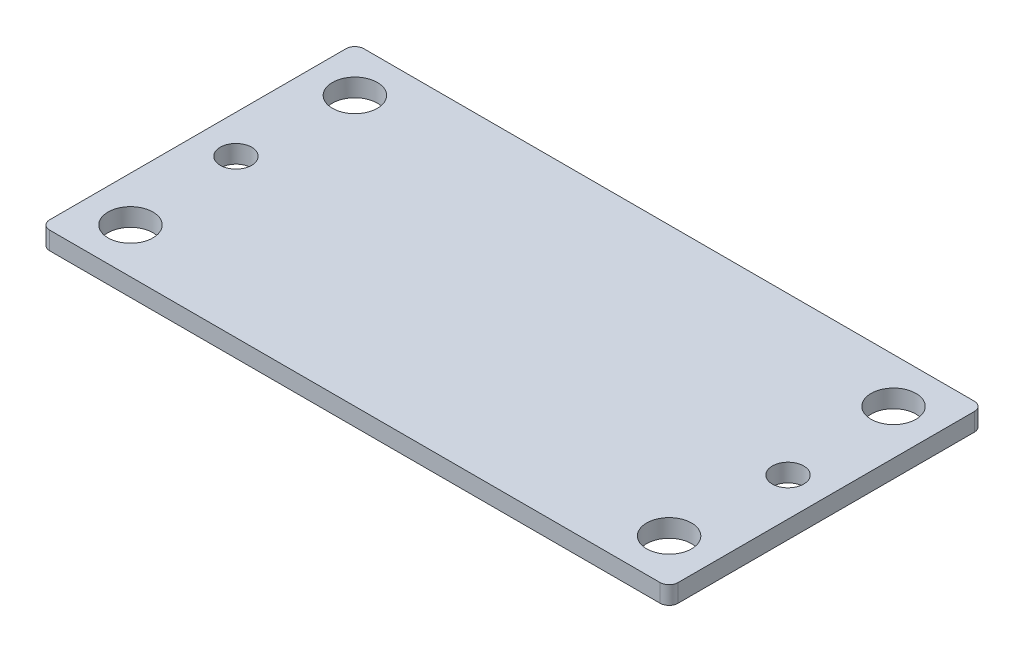
ISO-10303-21;
HEADER;
FILE_DESCRIPTION(('STEP AP214'),'2;1');
FILE_NAME('part.step','',(''),(''),'','','');
FILE_SCHEMA(('AUTOMOTIVE_DESIGN { 1 0 10303 214 1 1 1 1 }'));
ENDSEC;
DATA;
#1=APPLICATION_CONTEXT('core data for automotive mechanical design processes');
#2=APPLICATION_PROTOCOL_DEFINITION('international standard','automotive_design',2000,#1);
#3=PRODUCT_CONTEXT('',#1,'mechanical');
#4=PRODUCT('Part','Part','',(#3));
#5=PRODUCT_RELATED_PRODUCT_CATEGORY('part','',(#4));
#6=PRODUCT_DEFINITION_FORMATION('','',#4);
#7=PRODUCT_DEFINITION_CONTEXT('part definition',#1,'design');
#8=PRODUCT_DEFINITION('design','',#6,#7);
#9=PRODUCT_DEFINITION_SHAPE('','',#8);
#10=(LENGTH_UNIT() NAMED_UNIT(*) SI_UNIT(.MILLI.,.METRE.));
#11=(NAMED_UNIT(*) PLANE_ANGLE_UNIT() SI_UNIT($,.RADIAN.));
#12=(NAMED_UNIT(*) SI_UNIT($,.STERADIAN.) SOLID_ANGLE_UNIT());
#13=UNCERTAINTY_MEASURE_WITH_UNIT(LENGTH_MEASURE(1.E-05),#10,'distance_accuracy_value','');
#14=(GEOMETRIC_REPRESENTATION_CONTEXT(3) GLOBAL_UNCERTAINTY_ASSIGNED_CONTEXT((#13)) GLOBAL_UNIT_ASSIGNED_CONTEXT((#10,
#11,#12)) REPRESENTATION_CONTEXT('',''));
#15=CARTESIAN_POINT('',(0.,0.,0.));
#16=DIRECTION('',(0.,0.,1.));
#17=DIRECTION('',(1.,0.,0.));
#18=AXIS2_PLACEMENT_3D('',#15,#16,#17);
#19=CARTESIAN_POINT('',(0.,2.,0.));
#20=DIRECTION('',(1.,0.,0.));
#21=DIRECTION('',(0.,0.,-1.));
#22=AXIS2_PLACEMENT_3D('',#19,#20,#21);
#23=PLANE('',#22);
#24=DIRECTION('',(0.,0.,1.));
#25=VECTOR('',#24,1.);
#26=CARTESIAN_POINT('',(0.,2.,0.));
#27=LINE('',#26,#25);
#28=CARTESIAN_POINT('',(0.,2.,-34.));
#29=VERTEX_POINT('',#28);
#30=CARTESIAN_POINT('',(0.,2.,-1.));
#31=VERTEX_POINT('',#30);
#32=EDGE_CURVE('E128',#29,#31,#27,.T.);
#33=ORIENTED_EDGE('',*,*,#32,.F.);
#34=DIRECTION('',(0.,-1.,0.));
#35=VECTOR('',#34,1.);
#36=CARTESIAN_POINT('',(0.,2.,-34.));
#37=LINE('',#36,#35);
#38=CARTESIAN_POINT('',(0.,0.,-34.));
#39=VERTEX_POINT('',#38);
#40=EDGE_CURVE('E112',#29,#39,#37,.T.);
#41=ORIENTED_EDGE('',*,*,#40,.T.);
#42=DIRECTION('',(0.,0.,1.));
#43=VECTOR('',#42,1.);
#44=CARTESIAN_POINT('',(0.,0.,0.));
#45=LINE('',#44,#43);
#46=CARTESIAN_POINT('',(0.,0.,-1.));
#47=VERTEX_POINT('',#46);
#48=EDGE_CURVE('E125',#39,#47,#45,.T.);
#49=ORIENTED_EDGE('',*,*,#48,.T.);
#50=DIRECTION('',(0.,-1.,0.));
#51=VECTOR('',#50,1.);
#52=CARTESIAN_POINT('',(0.,2.,-1.));
#53=LINE('',#52,#51);
#54=EDGE_CURVE('E131',#47,#31,#53,.F.);
#55=ORIENTED_EDGE('',*,*,#54,.T.);
#56=EDGE_LOOP('',(#33,#41,#49,#55));
#57=FACE_BOUND('',#56,.T.);
#58=ADVANCED_FACE('F41',(#57),#23,.F.);
#59=CARTESIAN_POINT('',(0.,2.,0.));
#60=DIRECTION('',(0.,0.,-1.));
#61=DIRECTION('',(-1.,0.,0.));
#62=AXIS2_PLACEMENT_3D('',#59,#60,#61);
#63=PLANE('',#62);
#64=DIRECTION('',(1.,0.,0.));
#65=VECTOR('',#64,1.);
#66=CARTESIAN_POINT('',(0.,2.,0.));
#67=LINE('',#66,#65);
#68=CARTESIAN_POINT('',(1.,2.,0.));
#69=VERTEX_POINT('',#68);
#70=CARTESIAN_POINT('',(69.,2.,0.));
#71=VERTEX_POINT('',#70);
#72=EDGE_CURVE('E193',#69,#71,#67,.T.);
#73=ORIENTED_EDGE('',*,*,#72,.F.);
#74=DIRECTION('',(0.,-1.,0.));
#75=VECTOR('',#74,1.);
#76=CARTESIAN_POINT('',(1.,2.,0.));
#77=LINE('',#76,#75);
#78=CARTESIAN_POINT('',(1.,0.,0.));
#79=VERTEX_POINT('',#78);
#80=EDGE_CURVE('E184',#69,#79,#77,.T.);
#81=ORIENTED_EDGE('',*,*,#80,.T.);
#82=DIRECTION('',(1.,0.,0.));
#83=VECTOR('',#82,1.);
#84=CARTESIAN_POINT('',(0.,0.,0.));
#85=LINE('',#84,#83);
#86=CARTESIAN_POINT('',(69.,0.,0.));
#87=VERTEX_POINT('',#86);
#88=EDGE_CURVE('E136',#79,#87,#85,.T.);
#89=ORIENTED_EDGE('',*,*,#88,.T.);
#90=DIRECTION('',(0.,-1.,0.));
#91=VECTOR('',#90,1.);
#92=CARTESIAN_POINT('',(69.,2.,0.));
#93=LINE('',#92,#91);
#94=EDGE_CURVE('E181',#87,#71,#93,.F.);
#95=ORIENTED_EDGE('',*,*,#94,.T.);
#96=EDGE_LOOP('',(#73,#81,#89,#95));
#97=FACE_BOUND('',#96,.T.);
#98=ADVANCED_FACE('F273',(#97),#63,.F.);
#99=CARTESIAN_POINT('',(70.,2.,0.));
#100=DIRECTION('',(-1.,0.,0.));
#101=DIRECTION('',(0.,0.,1.));
#102=AXIS2_PLACEMENT_3D('',#99,#100,#101);
#103=PLANE('',#102);
#104=DIRECTION('',(0.,0.,-1.));
#105=VECTOR('',#104,1.);
#106=CARTESIAN_POINT('',(70.,2.,0.));
#107=LINE('',#106,#105);
#108=CARTESIAN_POINT('',(70.,2.,-1.));
#109=VERTEX_POINT('',#108);
#110=CARTESIAN_POINT('',(70.,2.,-34.));
#111=VERTEX_POINT('',#110);
#112=EDGE_CURVE('E191',#109,#111,#107,.T.);
#113=ORIENTED_EDGE('',*,*,#112,.F.);
#114=DIRECTION('',(0.,-1.,0.));
#115=VECTOR('',#114,1.);
#116=CARTESIAN_POINT('',(70.,2.,-1.));
#117=LINE('',#116,#115);
#118=CARTESIAN_POINT('',(70.,0.,-1.));
#119=VERTEX_POINT('',#118);
#120=EDGE_CURVE('E11',#109,#119,#117,.T.);
#121=ORIENTED_EDGE('',*,*,#120,.T.);
#122=DIRECTION('',(0.,0.,-1.));
#123=VECTOR('',#122,1.);
#124=CARTESIAN_POINT('',(70.,0.,0.));
#125=LINE('',#124,#123);
#126=CARTESIAN_POINT('',(70.,0.,-34.));
#127=VERTEX_POINT('',#126);
#128=EDGE_CURVE('E142',#119,#127,#125,.T.);
#129=ORIENTED_EDGE('',*,*,#128,.T.);
#130=DIRECTION('',(0.,-1.,0.));
#131=VECTOR('',#130,1.);
#132=CARTESIAN_POINT('',(70.,2.,-34.));
#133=LINE('',#132,#131);
#134=EDGE_CURVE('E50',#127,#111,#133,.F.);
#135=ORIENTED_EDGE('',*,*,#134,.T.);
#136=EDGE_LOOP('',(#113,#121,#129,#135));
#137=FACE_BOUND('',#136,.T.);
#138=ADVANCED_FACE('F266',(#137),#103,.F.);
#139=CARTESIAN_POINT('',(0.,2.,-35.));
#140=DIRECTION('',(0.,0.,1.));
#141=DIRECTION('',(1.,0.,0.));
#142=AXIS2_PLACEMENT_3D('',#139,#140,#141);
#143=PLANE('',#142);
#144=DIRECTION('',(-1.,0.,0.));
#145=VECTOR('',#144,1.);
#146=CARTESIAN_POINT('',(0.,0.,-35.));
#147=LINE('',#146,#145);
#148=CARTESIAN_POINT('',(69.,0.,-35.));
#149=VERTEX_POINT('',#148);
#150=CARTESIAN_POINT('',(1.,0.,-35.));
#151=VERTEX_POINT('',#150);
#152=EDGE_CURVE('E153',#149,#151,#147,.T.);
#153=ORIENTED_EDGE('',*,*,#152,.T.);
#154=DIRECTION('',(0.,-1.,0.));
#155=VECTOR('',#154,1.);
#156=CARTESIAN_POINT('',(1.,2.,-35.));
#157=LINE('',#156,#155);
#158=CARTESIAN_POINT('',(1.,2.,-35.));
#159=VERTEX_POINT('',#158);
#160=EDGE_CURVE('E113',#151,#159,#157,.F.);
#161=ORIENTED_EDGE('',*,*,#160,.T.);
#162=DIRECTION('',(-1.,0.,0.));
#163=VECTOR('',#162,1.);
#164=CARTESIAN_POINT('',(0.,2.,-35.));
#165=LINE('',#164,#163);
#166=CARTESIAN_POINT('',(69.,2.,-35.));
#167=VERTEX_POINT('',#166);
#168=EDGE_CURVE('E148',#167,#159,#165,.T.);
#169=ORIENTED_EDGE('',*,*,#168,.F.);
#170=DIRECTION('',(0.,-1.,0.));
#171=VECTOR('',#170,1.);
#172=CARTESIAN_POINT('',(69.,2.,-35.));
#173=LINE('',#172,#171);
#174=EDGE_CURVE('E119',#167,#149,#173,.T.);
#175=ORIENTED_EDGE('',*,*,#174,.T.);
#176=EDGE_LOOP('',(#153,#161,#169,#175));
#177=FACE_BOUND('',#176,.T.);
#178=ADVANCED_FACE('F256',(#177),#143,.F.);
#179=CARTESIAN_POINT('',(0.,2.,0.));
#180=DIRECTION('',(0.,-1.,0.));
#181=DIRECTION('',(0.,0.,-1.));
#182=AXIS2_PLACEMENT_3D('',#179,#180,#181);
#183=PLANE('',#182);
#184=CARTESIAN_POINT('',(65.,2.,-30.));
#185=DIRECTION('',(0.,-1.,0.));
#186=DIRECTION('',(0.,0.,-1.));
#187=AXIS2_PLACEMENT_3D('',#184,#185,#186);
#188=CIRCLE('',#187,2.49999999999999);
#189=CARTESIAN_POINT('',(65.,2.,-32.5));
#190=VERTEX_POINT('',#189);
#191=EDGE_CURVE('E137',#190,#190,#188,.T.);
#192=ORIENTED_EDGE('',*,*,#191,.T.);
#193=EDGE_LOOP('',(#192));
#194=FACE_BOUND('',#193,.T.);
#195=CARTESIAN_POINT('',(65.,2.,-5.));
#196=DIRECTION('',(0.,-1.,0.));
#197=DIRECTION('',(0.,0.,-1.));
#198=AXIS2_PLACEMENT_3D('',#195,#196,#197);
#199=CIRCLE('',#198,2.5);
#200=CARTESIAN_POINT('',(65.,2.,-7.5));
#201=VERTEX_POINT('',#200);
#202=EDGE_CURVE('E145',#201,#201,#199,.T.);
#203=ORIENTED_EDGE('',*,*,#202,.T.);
#204=EDGE_LOOP('',(#203));
#205=FACE_BOUND('',#204,.T.);
#206=CARTESIAN_POINT('',(65.75,2.,-17.5));
#207=DIRECTION('',(0.,-1.,0.));
#208=DIRECTION('',(0.,0.,-1.));
#209=AXIS2_PLACEMENT_3D('',#206,#207,#208);
#210=CIRCLE('',#209,1.75000000000001);
#211=CARTESIAN_POINT('',(65.75,2.,-19.25));
#212=VERTEX_POINT('',#211);
#213=EDGE_CURVE('E202',#212,#212,#210,.T.);
#214=ORIENTED_EDGE('',*,*,#213,.T.);
#215=EDGE_LOOP('',(#214));
#216=FACE_BOUND('',#215,.T.);
#217=CARTESIAN_POINT('',(4.25,2.,-17.5));
#218=DIRECTION('',(0.,-1.,0.));
#219=DIRECTION('',(0.,0.,-1.));
#220=AXIS2_PLACEMENT_3D('',#217,#218,#219);
#221=CIRCLE('',#220,1.75);
#222=CARTESIAN_POINT('',(4.25,2.,-19.25));
#223=VERTEX_POINT('',#222);
#224=EDGE_CURVE('E206',#223,#223,#221,.T.);
#225=ORIENTED_EDGE('',*,*,#224,.T.);
#226=EDGE_LOOP('',(#225));
#227=FACE_BOUND('',#226,.T.);
#228=CARTESIAN_POINT('',(5.,2.,-5.));
#229=DIRECTION('',(0.,-1.,0.));
#230=DIRECTION('',(0.,0.,-1.));
#231=AXIS2_PLACEMENT_3D('',#228,#229,#230);
#232=CIRCLE('',#231,2.5);
#233=CARTESIAN_POINT('',(5.,2.,-7.5));
#234=VERTEX_POINT('',#233);
#235=EDGE_CURVE('E210',#234,#234,#232,.T.);
#236=ORIENTED_EDGE('',*,*,#235,.T.);
#237=EDGE_LOOP('',(#236));
#238=FACE_BOUND('',#237,.T.);
#239=CARTESIAN_POINT('',(5.,2.,-30.));
#240=DIRECTION('',(0.,-1.,0.));
#241=DIRECTION('',(0.,0.,-1.));
#242=AXIS2_PLACEMENT_3D('',#239,#240,#241);
#243=CIRCLE('',#242,2.5);
#244=CARTESIAN_POINT('',(5.,2.,-32.5));
#245=VERTEX_POINT('',#244);
#246=EDGE_CURVE('E214',#245,#245,#243,.T.);
#247=ORIENTED_EDGE('',*,*,#246,.T.);
#248=EDGE_LOOP('',(#247));
#249=FACE_BOUND('',#248,.T.);
#250=ORIENTED_EDGE('',*,*,#168,.T.);
#251=CARTESIAN_POINT('',(1.,2.,-34.));
#252=DIRECTION('',(0.,-1.,0.));
#253=DIRECTION('',(0.,0.,-1.));
#254=AXIS2_PLACEMENT_3D('',#251,#252,#253);
#255=CIRCLE('',#254,1.);
#256=EDGE_CURVE('E178',#159,#29,#255,.F.);
#257=ORIENTED_EDGE('',*,*,#256,.T.);
#258=ORIENTED_EDGE('',*,*,#32,.T.);
#259=CARTESIAN_POINT('',(1.,2.,-1.));
#260=DIRECTION('',(0.,-1.,0.));
#261=DIRECTION('',(0.,0.,-1.));
#262=AXIS2_PLACEMENT_3D('',#259,#260,#261);
#263=CIRCLE('',#262,1.);
#264=EDGE_CURVE('E175',#31,#69,#263,.F.);
#265=ORIENTED_EDGE('',*,*,#264,.T.);
#266=ORIENTED_EDGE('',*,*,#72,.T.);
#267=CARTESIAN_POINT('',(69.,2.,-1.));
#268=DIRECTION('',(0.,-1.,0.));
#269=DIRECTION('',(0.,0.,-1.));
#270=AXIS2_PLACEMENT_3D('',#267,#268,#269);
#271=CIRCLE('',#270,1.);
#272=EDGE_CURVE('E63',#71,#109,#271,.F.);
#273=ORIENTED_EDGE('',*,*,#272,.T.);
#274=ORIENTED_EDGE('',*,*,#112,.T.);
#275=CARTESIAN_POINT('',(69.,2.,-34.));
#276=DIRECTION('',(0.,-1.,0.));
#277=DIRECTION('',(0.,0.,-1.));
#278=AXIS2_PLACEMENT_3D('',#275,#276,#277);
#279=CIRCLE('',#278,1.);
#280=EDGE_CURVE('E170',#111,#167,#279,.F.);
#281=ORIENTED_EDGE('',*,*,#280,.T.);
#282=EDGE_LOOP('',(#250,#257,#258,#265,#266,#273,#274,#281));
#283=FACE_BOUND('',#282,.T.);
#284=ADVANCED_FACE('F253',(#194,#205,#216,#227,#238,#249,#283),#183,.F.);
#285=CARTESIAN_POINT('',(0.,0.,0.));
#286=DIRECTION('',(0.,-1.,0.));
#287=DIRECTION('',(0.,0.,-1.));
#288=AXIS2_PLACEMENT_3D('',#285,#286,#287);
#289=PLANE('',#288);
#290=CARTESIAN_POINT('',(65.,0.,-30.));
#291=DIRECTION('',(0.,1.,0.));
#292=DIRECTION('',(0.,0.,-1.));
#293=AXIS2_PLACEMENT_3D('',#290,#291,#292);
#294=CIRCLE('',#293,2.49999999999999);
#295=CARTESIAN_POINT('',(65.,0.,-32.5));
#296=VERTEX_POINT('',#295);
#297=EDGE_CURVE('E223',#296,#296,#294,.T.);
#298=ORIENTED_EDGE('',*,*,#297,.T.);
#299=EDGE_LOOP('',(#298));
#300=FACE_BOUND('',#299,.T.);
#301=CARTESIAN_POINT('',(65.,0.,-5.));
#302=DIRECTION('',(0.,1.,0.));
#303=DIRECTION('',(0.,0.,-1.));
#304=AXIS2_PLACEMENT_3D('',#301,#302,#303);
#305=CIRCLE('',#304,2.5);
#306=CARTESIAN_POINT('',(65.,0.,-7.5));
#307=VERTEX_POINT('',#306);
#308=EDGE_CURVE('E227',#307,#307,#305,.T.);
#309=ORIENTED_EDGE('',*,*,#308,.T.);
#310=EDGE_LOOP('',(#309));
#311=FACE_BOUND('',#310,.T.);
#312=CARTESIAN_POINT('',(65.75,0.,-17.5));
#313=DIRECTION('',(0.,1.,0.));
#314=DIRECTION('',(0.,0.,-1.));
#315=AXIS2_PLACEMENT_3D('',#312,#313,#314);
#316=CIRCLE('',#315,1.75000000000001);
#317=CARTESIAN_POINT('',(65.75,0.,-19.25));
#318=VERTEX_POINT('',#317);
#319=EDGE_CURVE('E231',#318,#318,#316,.T.);
#320=ORIENTED_EDGE('',*,*,#319,.T.);
#321=EDGE_LOOP('',(#320));
#322=FACE_BOUND('',#321,.T.);
#323=CARTESIAN_POINT('',(4.25,0.,-17.5));
#324=DIRECTION('',(0.,1.,0.));
#325=DIRECTION('',(0.,0.,1.));
#326=AXIS2_PLACEMENT_3D('',#323,#324,#325);
#327=CIRCLE('',#326,1.75);
#328=CARTESIAN_POINT('',(4.25,0.,-15.75));
#329=VERTEX_POINT('',#328);
#330=EDGE_CURVE('E235',#329,#329,#327,.T.);
#331=ORIENTED_EDGE('',*,*,#330,.T.);
#332=EDGE_LOOP('',(#331));
#333=FACE_BOUND('',#332,.T.);
#334=CARTESIAN_POINT('',(5.,0.,-5.));
#335=DIRECTION('',(0.,1.,0.));
#336=DIRECTION('',(0.,0.,1.));
#337=AXIS2_PLACEMENT_3D('',#334,#335,#336);
#338=CIRCLE('',#337,2.5);
#339=CARTESIAN_POINT('',(5.,0.,-2.5));
#340=VERTEX_POINT('',#339);
#341=EDGE_CURVE('E222',#340,#340,#338,.T.);
#342=ORIENTED_EDGE('',*,*,#341,.T.);
#343=EDGE_LOOP('',(#342));
#344=FACE_BOUND('',#343,.T.);
#345=CARTESIAN_POINT('',(5.,0.,-30.));
#346=DIRECTION('',(0.,1.,0.));
#347=DIRECTION('',(0.,0.,1.));
#348=AXIS2_PLACEMENT_3D('',#345,#346,#347);
#349=CIRCLE('',#348,2.5);
#350=CARTESIAN_POINT('',(5.,0.,-27.5));
#351=VERTEX_POINT('',#350);
#352=EDGE_CURVE('E218',#351,#351,#349,.T.);
#353=ORIENTED_EDGE('',*,*,#352,.T.);
#354=EDGE_LOOP('',(#353));
#355=FACE_BOUND('',#354,.T.);
#356=ORIENTED_EDGE('',*,*,#48,.F.);
#357=CARTESIAN_POINT('',(1.,0.,-34.));
#358=DIRECTION('',(0.,-1.,0.));
#359=DIRECTION('',(0.,0.,-1.));
#360=AXIS2_PLACEMENT_3D('',#357,#358,#359);
#361=CIRCLE('',#360,1.);
#362=EDGE_CURVE('E108',#39,#151,#361,.T.);
#363=ORIENTED_EDGE('',*,*,#362,.T.);
#364=ORIENTED_EDGE('',*,*,#152,.F.);
#365=CARTESIAN_POINT('',(69.,0.,-34.));
#366=DIRECTION('',(0.,-1.,0.));
#367=DIRECTION('',(0.,0.,-1.));
#368=AXIS2_PLACEMENT_3D('',#365,#366,#367);
#369=CIRCLE('',#368,1.);
#370=EDGE_CURVE('E130',#149,#127,#369,.T.);
#371=ORIENTED_EDGE('',*,*,#370,.T.);
#372=ORIENTED_EDGE('',*,*,#128,.F.);
#373=CARTESIAN_POINT('',(69.,0.,-1.));
#374=DIRECTION('',(0.,-1.,0.));
#375=DIRECTION('',(0.,0.,-1.));
#376=AXIS2_PLACEMENT_3D('',#373,#374,#375);
#377=CIRCLE('',#376,1.);
#378=EDGE_CURVE('E160',#119,#87,#377,.T.);
#379=ORIENTED_EDGE('',*,*,#378,.T.);
#380=ORIENTED_EDGE('',*,*,#88,.F.);
#381=CARTESIAN_POINT('',(1.,0.,-1.));
#382=DIRECTION('',(0.,-1.,0.));
#383=DIRECTION('',(0.,0.,-1.));
#384=AXIS2_PLACEMENT_3D('',#381,#382,#383);
#385=CIRCLE('',#384,1.);
#386=EDGE_CURVE('E120',#79,#47,#385,.T.);
#387=ORIENTED_EDGE('',*,*,#386,.T.);
#388=EDGE_LOOP('',(#356,#363,#364,#371,#372,#379,#380,#387));
#389=FACE_BOUND('',#388,.T.);
#390=ADVANCED_FACE('F133',(#300,#311,#322,#333,#344,#355,#389),#289,.T.);
#391=CARTESIAN_POINT('',(5.,0.,-30.));
#392=DIRECTION('',(0.,1.,0.));
#393=DIRECTION('',(0.,0.,1.));
#394=AXIS2_PLACEMENT_3D('',#391,#392,#393);
#395=CYLINDRICAL_SURFACE('',#394,2.5);
#396=ORIENTED_EDGE('',*,*,#352,.F.);
#397=EDGE_LOOP('',(#396));
#398=FACE_BOUND('',#397,.T.);
#399=ORIENTED_EDGE('',*,*,#246,.F.);
#400=EDGE_LOOP('',(#399));
#401=FACE_BOUND('',#400,.T.);
#402=ADVANCED_FACE('F249',(#398,#401),#395,.F.);
#403=CARTESIAN_POINT('',(5.,0.,-5.));
#404=DIRECTION('',(0.,1.,0.));
#405=DIRECTION('',(0.,0.,1.));
#406=AXIS2_PLACEMENT_3D('',#403,#404,#405);
#407=CYLINDRICAL_SURFACE('',#406,2.5);
#408=ORIENTED_EDGE('',*,*,#341,.F.);
#409=EDGE_LOOP('',(#408));
#410=FACE_BOUND('',#409,.T.);
#411=ORIENTED_EDGE('',*,*,#235,.F.);
#412=EDGE_LOOP('',(#411));
#413=FACE_BOUND('',#412,.T.);
#414=ADVANCED_FACE('F245',(#410,#413),#407,.F.);
#415=CARTESIAN_POINT('',(4.25,0.,-17.5));
#416=DIRECTION('',(0.,1.,0.));
#417=DIRECTION('',(0.,0.,1.));
#418=AXIS2_PLACEMENT_3D('',#415,#416,#417);
#419=CYLINDRICAL_SURFACE('',#418,1.75);
#420=ORIENTED_EDGE('',*,*,#330,.F.);
#421=EDGE_LOOP('',(#420));
#422=FACE_BOUND('',#421,.T.);
#423=ORIENTED_EDGE('',*,*,#224,.F.);
#424=EDGE_LOOP('',(#423));
#425=FACE_BOUND('',#424,.T.);
#426=ADVANCED_FACE('F248',(#422,#425),#419,.F.);
#427=CARTESIAN_POINT('',(65.75,0.,-17.5));
#428=DIRECTION('',(0.,1.,0.));
#429=DIRECTION('',(0.,0.,1.));
#430=AXIS2_PLACEMENT_3D('',#427,#428,#429);
#431=CYLINDRICAL_SURFACE('',#430,1.75000000000001);
#432=ORIENTED_EDGE('',*,*,#319,.F.);
#433=EDGE_LOOP('',(#432));
#434=FACE_BOUND('',#433,.T.);
#435=ORIENTED_EDGE('',*,*,#213,.F.);
#436=EDGE_LOOP('',(#435));
#437=FACE_BOUND('',#436,.T.);
#438=ADVANCED_FACE('F308',(#434,#437),#431,.F.);
#439=CARTESIAN_POINT('',(65.,0.,-5.));
#440=DIRECTION('',(0.,1.,0.));
#441=DIRECTION('',(0.,0.,1.));
#442=AXIS2_PLACEMENT_3D('',#439,#440,#441);
#443=CYLINDRICAL_SURFACE('',#442,2.5);
#444=ORIENTED_EDGE('',*,*,#308,.F.);
#445=EDGE_LOOP('',(#444));
#446=FACE_BOUND('',#445,.T.);
#447=ORIENTED_EDGE('',*,*,#202,.F.);
#448=EDGE_LOOP('',(#447));
#449=FACE_BOUND('',#448,.T.);
#450=ADVANCED_FACE('F304',(#446,#449),#443,.F.);
#451=CARTESIAN_POINT('',(65.,0.,-30.));
#452=DIRECTION('',(0.,1.,0.));
#453=DIRECTION('',(0.,0.,1.));
#454=AXIS2_PLACEMENT_3D('',#451,#452,#453);
#455=CYLINDRICAL_SURFACE('',#454,2.49999999999999);
#456=ORIENTED_EDGE('',*,*,#297,.F.);
#457=EDGE_LOOP('',(#456));
#458=FACE_BOUND('',#457,.T.);
#459=ORIENTED_EDGE('',*,*,#191,.F.);
#460=EDGE_LOOP('',(#459));
#461=FACE_BOUND('',#460,.T.);
#462=ADVANCED_FACE('F283',(#458,#461),#455,.F.);
#463=CARTESIAN_POINT('',(1.,2.,-34.));
#464=DIRECTION('',(0.,-1.,0.));
#465=DIRECTION('',(0.,0.,-1.));
#466=AXIS2_PLACEMENT_3D('',#463,#464,#465);
#467=CYLINDRICAL_SURFACE('',#466,1.);
#468=ORIENTED_EDGE('',*,*,#256,.F.);
#469=ORIENTED_EDGE('',*,*,#160,.F.);
#470=ORIENTED_EDGE('',*,*,#362,.F.);
#471=ORIENTED_EDGE('',*,*,#40,.F.);
#472=EDGE_LOOP('',(#468,#469,#470,#471));
#473=FACE_BOUND('',#472,.T.);
#474=ADVANCED_FACE('F111',(#473),#467,.T.);
#475=CARTESIAN_POINT('',(1.,2.,-1.));
#476=DIRECTION('',(0.,-1.,0.));
#477=DIRECTION('',(0.,0.,-1.));
#478=AXIS2_PLACEMENT_3D('',#475,#476,#477);
#479=CYLINDRICAL_SURFACE('',#478,1.);
#480=ORIENTED_EDGE('',*,*,#264,.F.);
#481=ORIENTED_EDGE('',*,*,#54,.F.);
#482=ORIENTED_EDGE('',*,*,#386,.F.);
#483=ORIENTED_EDGE('',*,*,#80,.F.);
#484=EDGE_LOOP('',(#480,#481,#482,#483));
#485=FACE_BOUND('',#484,.T.);
#486=ADVANCED_FACE('F276',(#485),#479,.T.);
#487=CARTESIAN_POINT('',(69.,2.,-1.));
#488=DIRECTION('',(0.,-1.,0.));
#489=DIRECTION('',(0.,0.,-1.));
#490=AXIS2_PLACEMENT_3D('',#487,#488,#489);
#491=CYLINDRICAL_SURFACE('',#490,1.);
#492=ORIENTED_EDGE('',*,*,#272,.F.);
#493=ORIENTED_EDGE('',*,*,#94,.F.);
#494=ORIENTED_EDGE('',*,*,#378,.F.);
#495=ORIENTED_EDGE('',*,*,#120,.F.);
#496=EDGE_LOOP('',(#492,#493,#494,#495));
#497=FACE_BOUND('',#496,.T.);
#498=ADVANCED_FACE('F269',(#497),#491,.T.);
#499=CARTESIAN_POINT('',(69.,2.,-34.));
#500=DIRECTION('',(0.,-1.,0.));
#501=DIRECTION('',(0.,0.,-1.));
#502=AXIS2_PLACEMENT_3D('',#499,#500,#501);
#503=CYLINDRICAL_SURFACE('',#502,1.);
#504=ORIENTED_EDGE('',*,*,#280,.F.);
#505=ORIENTED_EDGE('',*,*,#134,.F.);
#506=ORIENTED_EDGE('',*,*,#370,.F.);
#507=ORIENTED_EDGE('',*,*,#174,.F.);
#508=EDGE_LOOP('',(#504,#505,#506,#507));
#509=FACE_BOUND('',#508,.T.);
#510=ADVANCED_FACE('F43',(#509),#503,.T.);
#511=CLOSED_SHELL('',(#58,#98,#138,#178,#284,#390,#402,#414,#426,#438,#450,#462,#474,#486,#498,#510));
#512=MANIFOLD_SOLID_BREP('B2',#511);
#513=ADVANCED_BREP_SHAPE_REPRESENTATION('',(#18,#512),#14);
#514=SHAPE_DEFINITION_REPRESENTATION(#9,#513);
ENDSEC;
END-ISO-10303-21;
